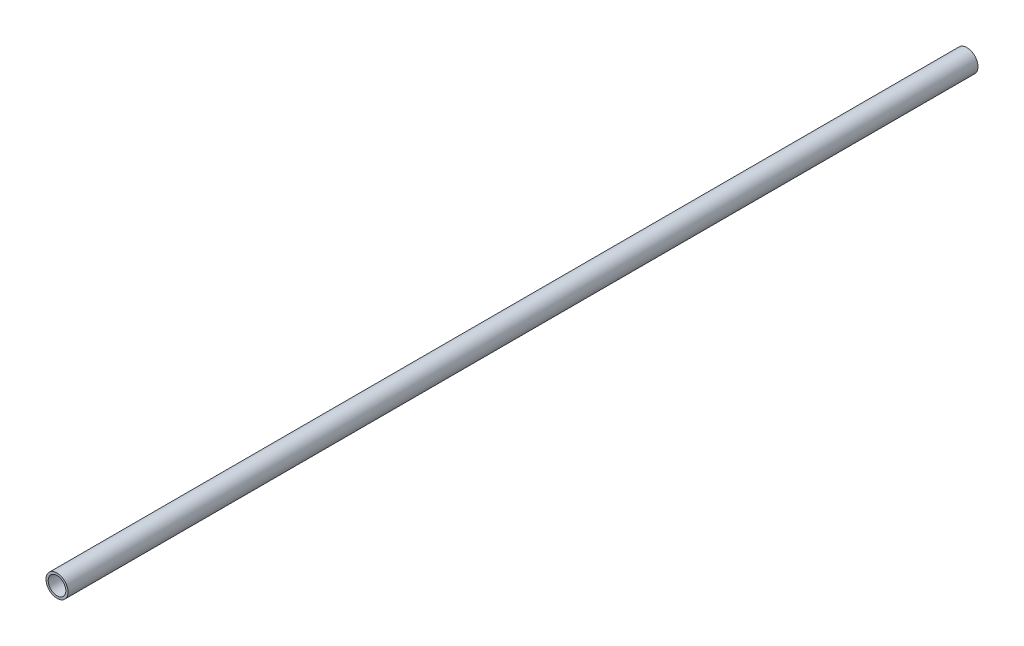
ISO-10303-21;
HEADER;
FILE_DESCRIPTION(('STEP AP214'),'2;1');
FILE_NAME('part.step','',(''),(''),'','','');
FILE_SCHEMA(('AUTOMOTIVE_DESIGN { 1 0 10303 214 1 1 1 1 }'));
ENDSEC;
DATA;
#1=APPLICATION_CONTEXT('core data for automotive mechanical design processes');
#2=APPLICATION_PROTOCOL_DEFINITION('international standard','automotive_design',2000,#1);
#3=PRODUCT_CONTEXT('',#1,'mechanical');
#4=PRODUCT('Part','Part','',(#3));
#5=PRODUCT_RELATED_PRODUCT_CATEGORY('part','',(#4));
#6=PRODUCT_DEFINITION_FORMATION('','',#4);
#7=PRODUCT_DEFINITION_CONTEXT('part definition',#1,'design');
#8=PRODUCT_DEFINITION('design','',#6,#7);
#9=PRODUCT_DEFINITION_SHAPE('','',#8);
#10=(LENGTH_UNIT() NAMED_UNIT(*) SI_UNIT(.MILLI.,.METRE.));
#11=(NAMED_UNIT(*) PLANE_ANGLE_UNIT() SI_UNIT($,.RADIAN.));
#12=(NAMED_UNIT(*) SI_UNIT($,.STERADIAN.) SOLID_ANGLE_UNIT());
#13=UNCERTAINTY_MEASURE_WITH_UNIT(LENGTH_MEASURE(1.E-05),#10,'distance_accuracy_value','');
#14=(GEOMETRIC_REPRESENTATION_CONTEXT(3) GLOBAL_UNCERTAINTY_ASSIGNED_CONTEXT((#13)) GLOBAL_UNIT_ASSIGNED_CONTEXT((#10,
#11,#12)) REPRESENTATION_CONTEXT('',''));
#15=CARTESIAN_POINT('',(0.,0.,0.));
#16=DIRECTION('',(0.,0.,1.));
#17=DIRECTION('',(1.,0.,0.));
#18=AXIS2_PLACEMENT_3D('',#15,#16,#17);
#19=CARTESIAN_POINT('',(0.,0.,206.375));
#20=DIRECTION('',(0.,0.,1.));
#21=DIRECTION('',(1.,0.,0.));
#22=AXIS2_PLACEMENT_3D('',#19,#20,#21);
#23=PLANE('',#22);
#24=CARTESIAN_POINT('',(0.,0.,206.375));
#25=DIRECTION('',(0.,0.,1.));
#26=DIRECTION('',(1.,0.,0.));
#27=AXIS2_PLACEMENT_3D('',#24,#25,#26);
#28=CIRCLE('',#27,2.5);
#29=CARTESIAN_POINT('',(2.5,0.,206.375));
#30=VERTEX_POINT('',#29);
#31=EDGE_CURVE('E10',#30,#30,#28,.T.);
#32=ORIENTED_EDGE('',*,*,#31,.T.);
#33=EDGE_LOOP('',(#32));
#34=FACE_BOUND('',#33,.T.);
#35=CARTESIAN_POINT('',(0.,0.,206.375));
#36=DIRECTION('',(0.,0.,1.));
#37=DIRECTION('',(1.,0.,0.));
#38=AXIS2_PLACEMENT_3D('',#35,#36,#37);
#39=CIRCLE('',#38,2.);
#40=CARTESIAN_POINT('',(2.,0.,206.375));
#41=VERTEX_POINT('',#40);
#42=EDGE_CURVE('E50',#41,#41,#39,.T.);
#43=ORIENTED_EDGE('',*,*,#42,.F.);
#44=EDGE_LOOP('',(#43));
#45=FACE_BOUND('',#44,.T.);
#46=ADVANCED_FACE('F37',(#34,#45),#23,.T.);
#47=CARTESIAN_POINT('',(0.,0.,0.));
#48=DIRECTION('',(0.,0.,1.));
#49=DIRECTION('',(1.,0.,0.));
#50=AXIS2_PLACEMENT_3D('',#47,#48,#49);
#51=PLANE('',#50);
#52=CARTESIAN_POINT('',(0.,0.,0.));
#53=DIRECTION('',(0.,0.,1.));
#54=DIRECTION('',(1.,0.,0.));
#55=AXIS2_PLACEMENT_3D('',#52,#53,#54);
#56=CIRCLE('',#55,2.5);
#57=CARTESIAN_POINT('',(2.5,0.,0.));
#58=VERTEX_POINT('',#57);
#59=EDGE_CURVE('E41',#58,#58,#56,.T.);
#60=ORIENTED_EDGE('',*,*,#59,.F.);
#61=EDGE_LOOP('',(#60));
#62=FACE_BOUND('',#61,.T.);
#63=CARTESIAN_POINT('',(0.,0.,0.));
#64=DIRECTION('',(0.,0.,1.));
#65=DIRECTION('',(1.,0.,0.));
#66=AXIS2_PLACEMENT_3D('',#63,#64,#65);
#67=CIRCLE('',#66,2.);
#68=CARTESIAN_POINT('',(2.,0.,0.));
#69=VERTEX_POINT('',#68);
#70=EDGE_CURVE('E52',#69,#69,#67,.T.);
#71=ORIENTED_EDGE('',*,*,#70,.T.);
#72=EDGE_LOOP('',(#71));
#73=FACE_BOUND('',#72,.T.);
#74=ADVANCED_FACE('F64',(#62,#73),#51,.F.);
#75=CARTESIAN_POINT('',(0.,0.,206.375));
#76=DIRECTION('',(0.,0.,-1.));
#77=DIRECTION('',(-1.,0.,0.));
#78=AXIS2_PLACEMENT_3D('',#75,#76,#77);
#79=CYLINDRICAL_SURFACE('',#78,2.5);
#80=ORIENTED_EDGE('',*,*,#31,.F.);
#81=EDGE_LOOP('',(#80));
#82=FACE_BOUND('',#81,.T.);
#83=ORIENTED_EDGE('',*,*,#59,.T.);
#84=EDGE_LOOP('',(#83));
#85=FACE_BOUND('',#84,.T.);
#86=ADVANCED_FACE('F39',(#82,#85),#79,.T.);
#87=CARTESIAN_POINT('',(0.,0.,206.375));
#88=DIRECTION('',(0.,0.,-1.));
#89=DIRECTION('',(-1.,0.,0.));
#90=AXIS2_PLACEMENT_3D('',#87,#88,#89);
#91=CYLINDRICAL_SURFACE('',#90,2.);
#92=ORIENTED_EDGE('',*,*,#42,.T.);
#93=EDGE_LOOP('',(#92));
#94=FACE_BOUND('',#93,.T.);
#95=ORIENTED_EDGE('',*,*,#70,.F.);
#96=EDGE_LOOP('',(#95));
#97=FACE_BOUND('',#96,.T.);
#98=ADVANCED_FACE('F60',(#94,#97),#91,.F.);
#99=CLOSED_SHELL('',(#46,#74,#86,#98));
#100=MANIFOLD_SOLID_BREP('B2',#99);
#101=ADVANCED_BREP_SHAPE_REPRESENTATION('',(#18,#100),#14);
#102=SHAPE_DEFINITION_REPRESENTATION(#9,#101);
ENDSEC;
END-ISO-10303-21;
